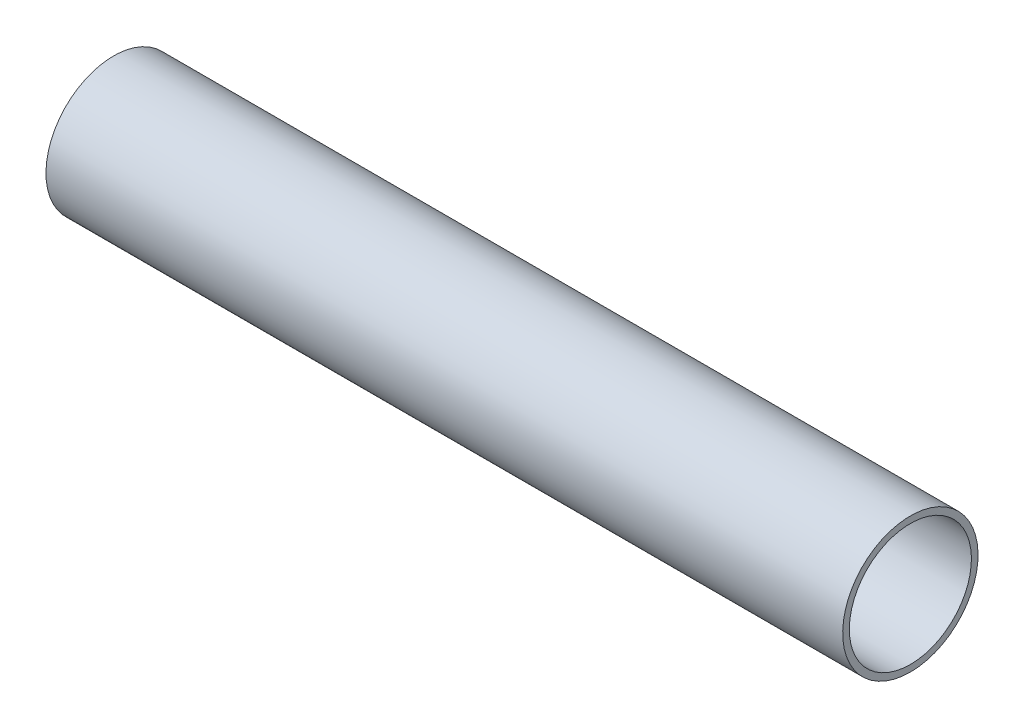
ISO-10303-21;
HEADER;
FILE_DESCRIPTION(('STEP AP214'),'2;1');
FILE_NAME('part.step','',(''),(''),'','','');
FILE_SCHEMA(('AUTOMOTIVE_DESIGN { 1 0 10303 214 1 1 1 1 }'));
ENDSEC;
DATA;
#1=APPLICATION_CONTEXT('core data for automotive mechanical design processes');
#2=APPLICATION_PROTOCOL_DEFINITION('international standard','automotive_design',2000,#1);
#3=PRODUCT_CONTEXT('',#1,'mechanical');
#4=PRODUCT('Part','Part','',(#3));
#5=PRODUCT_RELATED_PRODUCT_CATEGORY('part','',(#4));
#6=PRODUCT_DEFINITION_FORMATION('','',#4);
#7=PRODUCT_DEFINITION_CONTEXT('part definition',#1,'design');
#8=PRODUCT_DEFINITION('design','',#6,#7);
#9=PRODUCT_DEFINITION_SHAPE('','',#8);
#10=(LENGTH_UNIT() NAMED_UNIT(*) SI_UNIT(.MILLI.,.METRE.));
#11=(NAMED_UNIT(*) PLANE_ANGLE_UNIT() SI_UNIT($,.RADIAN.));
#12=(NAMED_UNIT(*) SI_UNIT($,.STERADIAN.) SOLID_ANGLE_UNIT());
#13=UNCERTAINTY_MEASURE_WITH_UNIT(LENGTH_MEASURE(1.E-05),#10,'distance_accuracy_value','');
#14=(GEOMETRIC_REPRESENTATION_CONTEXT(3) GLOBAL_UNCERTAINTY_ASSIGNED_CONTEXT((#13)) GLOBAL_UNIT_ASSIGNED_CONTEXT((#10,
#11,#12)) REPRESENTATION_CONTEXT('',''));
#15=CARTESIAN_POINT('',(0.,0.,0.));
#16=DIRECTION('',(0.,0.,1.));
#17=DIRECTION('',(1.,0.,0.));
#18=AXIS2_PLACEMENT_3D('',#15,#16,#17);
#19=CARTESIAN_POINT('',(-592.598230203423,-6.000440288623,0.));
#20=DIRECTION('',(1.,0.,0.));
#21=DIRECTION('',(0.,1.,0.));
#22=AXIS2_PLACEMENT_3D('',#19,#20,#21);
#23=PLANE('',#22);
#24=CARTESIAN_POINT('',(-592.598230203423,-0.000440288622985937,0.));
#25=DIRECTION('',(-1.,0.,0.));
#26=DIRECTION('',(0.,-1.,0.));
#27=AXIS2_PLACEMENT_3D('',#24,#25,#26);
#28=CIRCLE('',#27,6.00000000000001);
#29=CARTESIAN_POINT('',(-592.598230203423,-6.000440288623,0.));
#30=VERTEX_POINT('',#29);
#31=EDGE_CURVE('E10',#30,#30,#28,.T.);
#32=ORIENTED_EDGE('',*,*,#31,.T.);
#33=EDGE_LOOP('',(#32));
#34=FACE_BOUND('',#33,.T.);
#35=CARTESIAN_POINT('',(-592.598230203423,-0.000440288622985937,0.));
#36=DIRECTION('',(-1.,0.,0.));
#37=DIRECTION('',(0.,-1.,0.));
#38=AXIS2_PLACEMENT_3D('',#35,#36,#37);
#39=CIRCLE('',#38,6.65000000000001);
#40=CARTESIAN_POINT('',(-592.598230203423,-6.650440288623,0.));
#41=VERTEX_POINT('',#40);
#42=EDGE_CURVE('E47',#41,#41,#39,.T.);
#43=ORIENTED_EDGE('',*,*,#42,.F.);
#44=EDGE_LOOP('',(#43));
#45=FACE_BOUND('',#44,.T.);
#46=ADVANCED_FACE('F33',(#34,#45),#23,.T.);
#47=CARTESIAN_POINT('',(-666.248230203423,-0.00044028862299707,0.));
#48=DIRECTION('',(-1.,0.,0.));
#49=DIRECTION('',(0.,-1.,0.));
#50=AXIS2_PLACEMENT_3D('',#47,#48,#49);
#51=CYLINDRICAL_SURFACE('',#50,6.00000000000001);
#52=CARTESIAN_POINT('',(-670.898230203423,-0.000440288622997773,0.));
#53=DIRECTION('',(-1.,0.,0.));
#54=DIRECTION('',(0.,-1.,0.));
#55=AXIS2_PLACEMENT_3D('',#52,#53,#54);
#56=CIRCLE('',#55,6.);
#57=CARTESIAN_POINT('',(-670.898230203423,-6.000440288623,0.));
#58=VERTEX_POINT('',#57);
#59=EDGE_CURVE('E39',#58,#58,#56,.T.);
#60=ORIENTED_EDGE('',*,*,#59,.T.);
#61=EDGE_LOOP('',(#60));
#62=FACE_BOUND('',#61,.T.);
#63=ORIENTED_EDGE('',*,*,#31,.F.);
#64=EDGE_LOOP('',(#63));
#65=FACE_BOUND('',#64,.T.);
#66=ADVANCED_FACE('F57',(#62,#65),#51,.F.);
#67=CARTESIAN_POINT('',(-670.898230203423,-6.000440288623,0.));
#68=DIRECTION('',(-1.,0.,0.));
#69=DIRECTION('',(0.,-1.,0.));
#70=AXIS2_PLACEMENT_3D('',#67,#68,#69);
#71=PLANE('',#70);
#72=CARTESIAN_POINT('',(-670.898230203423,-0.000440288622997773,0.));
#73=DIRECTION('',(-1.,0.,0.));
#74=DIRECTION('',(0.,-1.,0.));
#75=AXIS2_PLACEMENT_3D('',#72,#73,#74);
#76=CIRCLE('',#75,6.65);
#77=CARTESIAN_POINT('',(-670.898230203423,-6.650440288623,0.));
#78=VERTEX_POINT('',#77);
#79=EDGE_CURVE('E43',#78,#78,#76,.T.);
#80=ORIENTED_EDGE('',*,*,#79,.T.);
#81=EDGE_LOOP('',(#80));
#82=FACE_BOUND('',#81,.T.);
#83=ORIENTED_EDGE('',*,*,#59,.F.);
#84=EDGE_LOOP('',(#83));
#85=FACE_BOUND('',#84,.T.);
#86=ADVANCED_FACE('F61',(#82,#85),#71,.T.);
#87=CARTESIAN_POINT('',(-666.248230203423,-0.00044028862299707,0.));
#88=DIRECTION('',(-1.,0.,0.));
#89=DIRECTION('',(0.,-1.,0.));
#90=AXIS2_PLACEMENT_3D('',#87,#88,#89);
#91=CYLINDRICAL_SURFACE('',#90,6.65000000000001);
#92=ORIENTED_EDGE('',*,*,#42,.T.);
#93=EDGE_LOOP('',(#92));
#94=FACE_BOUND('',#93,.T.);
#95=ORIENTED_EDGE('',*,*,#79,.F.);
#96=EDGE_LOOP('',(#95));
#97=FACE_BOUND('',#96,.T.);
#98=ADVANCED_FACE('F53',(#94,#97),#91,.T.);
#99=CLOSED_SHELL('',(#46,#66,#86,#98));
#100=MANIFOLD_SOLID_BREP('B2',#99);
#101=ADVANCED_BREP_SHAPE_REPRESENTATION('',(#18,#100),#14);
#102=SHAPE_DEFINITION_REPRESENTATION(#9,#101);
ENDSEC;
END-ISO-10303-21;
